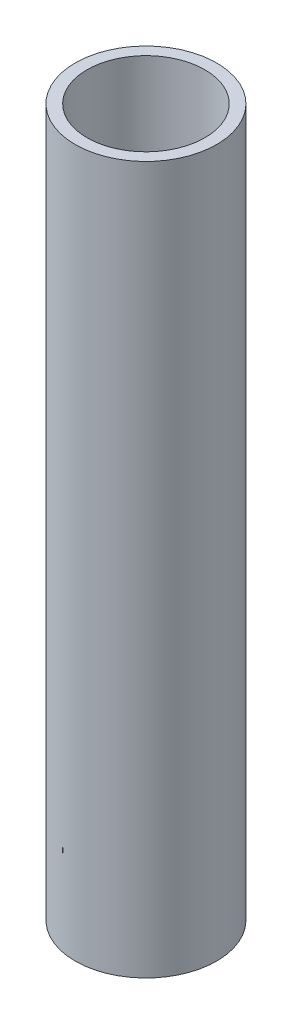
ISO-10303-21;
HEADER;
FILE_DESCRIPTION(('STEP AP214'),'2;1');
FILE_NAME('part.step','',(''),(''),'','','');
FILE_SCHEMA(('AUTOMOTIVE_DESIGN { 1 0 10303 214 1 1 1 1 }'));
ENDSEC;
DATA;
#1=APPLICATION_CONTEXT('core data for automotive mechanical design processes');
#2=APPLICATION_PROTOCOL_DEFINITION('international standard','automotive_design',2000,#1);
#3=PRODUCT_CONTEXT('',#1,'mechanical');
#4=PRODUCT('Part','Part','',(#3));
#5=PRODUCT_RELATED_PRODUCT_CATEGORY('part','',(#4));
#6=PRODUCT_DEFINITION_FORMATION('','',#4);
#7=PRODUCT_DEFINITION_CONTEXT('part definition',#1,'design');
#8=PRODUCT_DEFINITION('design','',#6,#7);
#9=PRODUCT_DEFINITION_SHAPE('','',#8);
#10=(LENGTH_UNIT() NAMED_UNIT(*) SI_UNIT(.MILLI.,.METRE.));
#11=(NAMED_UNIT(*) PLANE_ANGLE_UNIT() SI_UNIT($,.RADIAN.));
#12=(NAMED_UNIT(*) SI_UNIT($,.STERADIAN.) SOLID_ANGLE_UNIT());
#13=UNCERTAINTY_MEASURE_WITH_UNIT(LENGTH_MEASURE(1.E-05),#10,'distance_accuracy_value','');
#14=(GEOMETRIC_REPRESENTATION_CONTEXT(3) GLOBAL_UNCERTAINTY_ASSIGNED_CONTEXT((#13)) GLOBAL_UNIT_ASSIGNED_CONTEXT((#10,
#11,#12)) REPRESENTATION_CONTEXT('',''));
#15=CARTESIAN_POINT('',(0.,0.,0.));
#16=DIRECTION('',(0.,0.,1.));
#17=DIRECTION('',(1.,0.,0.));
#18=AXIS2_PLACEMENT_3D('',#15,#16,#17);
#19=CARTESIAN_POINT('',(-75.,450.,-42.3));
#20=DIRECTION('',(0.,-1.,0.));
#21=DIRECTION('',(0.,0.,-1.));
#22=AXIS2_PLACEMENT_3D('',#19,#20,#21);
#23=PLANE('',#22);
#24=CARTESIAN_POINT('',(0.,450.,0.));
#25=DIRECTION('',(0.,-1.,0.));
#26=DIRECTION('',(0.,0.,-1.));
#27=AXIS2_PLACEMENT_3D('',#24,#25,#26);
#28=CIRCLE('',#27,25.);
#29=CARTESIAN_POINT('',(0.,450.,-25.));
#30=VERTEX_POINT('',#29);
#31=EDGE_CURVE('E42',#30,#30,#28,.T.);
#32=ORIENTED_EDGE('',*,*,#31,.T.);
#33=EDGE_LOOP('',(#32));
#34=FACE_BOUND('',#33,.T.);
#35=CARTESIAN_POINT('',(0.,450.,0.));
#36=DIRECTION('',(0.,1.,0.));
#37=DIRECTION('',(0.,0.,1.));
#38=AXIS2_PLACEMENT_3D('',#35,#36,#37);
#39=CIRCLE('',#38,30.);
#40=CARTESIAN_POINT('',(0.,450.,30.));
#41=VERTEX_POINT('',#40);
#42=EDGE_CURVE('E10',#41,#41,#39,.T.);
#43=ORIENTED_EDGE('',*,*,#42,.T.);
#44=EDGE_LOOP('',(#43));
#45=FACE_BOUND('',#44,.T.);
#46=ADVANCED_FACE('F39',(#34,#45),#23,.F.);
#47=CARTESIAN_POINT('',(0.,150.,-40.));
#48=DIRECTION('',(0.,1.,0.));
#49=DIRECTION('',(0.,0.,1.));
#50=AXIS2_PLACEMENT_3D('',#47,#48,#49);
#51=PLANE('',#50);
#52=CARTESIAN_POINT('',(0.,150.,0.));
#53=DIRECTION('',(0.,1.,0.));
#54=DIRECTION('',(0.,0.,1.));
#55=AXIS2_PLACEMENT_3D('',#52,#53,#54);
#56=CIRCLE('',#55,25.);
#57=CARTESIAN_POINT('',(0.,150.,25.));
#58=VERTEX_POINT('',#57);
#59=EDGE_CURVE('E50',#58,#58,#56,.T.);
#60=ORIENTED_EDGE('',*,*,#59,.T.);
#61=EDGE_LOOP('',(#60));
#62=FACE_BOUND('',#61,.T.);
#63=CARTESIAN_POINT('',(0.,150.,0.));
#64=DIRECTION('',(0.,1.,0.));
#65=DIRECTION('',(0.,0.,1.));
#66=AXIS2_PLACEMENT_3D('',#63,#64,#65);
#67=CIRCLE('',#66,30.);
#68=CARTESIAN_POINT('',(0.,150.,30.));
#69=VERTEX_POINT('',#68);
#70=EDGE_CURVE('E52',#69,#69,#67,.T.);
#71=ORIENTED_EDGE('',*,*,#70,.F.);
#72=EDGE_LOOP('',(#71));
#73=FACE_BOUND('',#72,.T.);
#74=ADVANCED_FACE('F57',(#62,#73),#51,.F.);
#75=CARTESIAN_POINT('',(0.,450.,0.));
#76=DIRECTION('',(0.,-1.,0.));
#77=DIRECTION('',(0.,0.,-1.));
#78=AXIS2_PLACEMENT_3D('',#75,#76,#77);
#79=CYLINDRICAL_SURFACE('',#78,30.);
#80=ORIENTED_EDGE('',*,*,#42,.F.);
#81=EDGE_LOOP('',(#80));
#82=FACE_BOUND('',#81,.T.);
#83=ORIENTED_EDGE('',*,*,#70,.T.);
#84=EDGE_LOOP('',(#83));
#85=FACE_BOUND('',#84,.T.);
#86=ADVANCED_FACE('F62',(#82,#85),#79,.T.);
#87=CARTESIAN_POINT('',(0.,450.,0.));
#88=DIRECTION('',(0.,-1.,0.));
#89=DIRECTION('',(0.,0.,-1.));
#90=AXIS2_PLACEMENT_3D('',#87,#88,#89);
#91=CYLINDRICAL_SURFACE('',#90,25.);
#92=ORIENTED_EDGE('',*,*,#31,.F.);
#93=EDGE_LOOP('',(#92));
#94=FACE_BOUND('',#93,.T.);
#95=ORIENTED_EDGE('',*,*,#59,.F.);
#96=EDGE_LOOP('',(#95));
#97=FACE_BOUND('',#96,.T.);
#98=ADVANCED_FACE('F60',(#94,#97),#91,.F.);
#99=CLOSED_SHELL('',(#46,#74,#86,#98));
#100=MANIFOLD_SOLID_BREP('B2',#99);
#101=ADVANCED_BREP_SHAPE_REPRESENTATION('',(#18,#100),#14);
#102=SHAPE_DEFINITION_REPRESENTATION(#9,#101);
ENDSEC;
END-ISO-10303-21;
